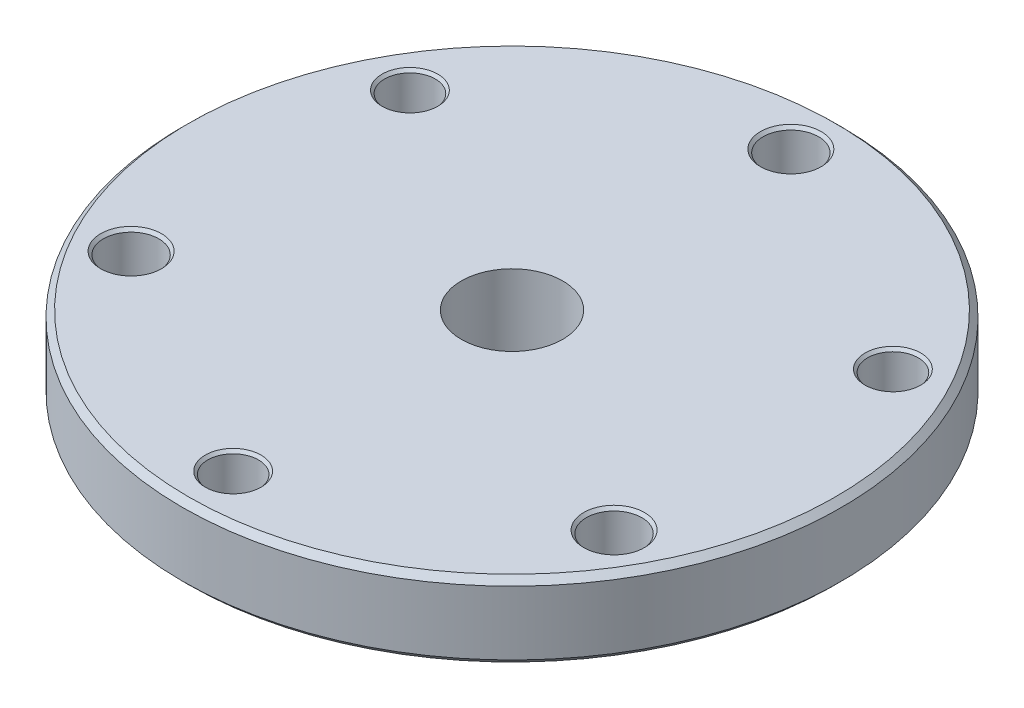
ISO-10303-21;
HEADER;
FILE_DESCRIPTION(('STEP AP214'),'2;1');
FILE_NAME('part.step','',(''),(''),'','','');
FILE_SCHEMA(('AUTOMOTIVE_DESIGN { 1 0 10303 214 1 1 1 1 }'));
ENDSEC;
DATA;
#1=APPLICATION_CONTEXT('core data for automotive mechanical design processes');
#2=APPLICATION_PROTOCOL_DEFINITION('international standard','automotive_design',2000,#1);
#3=PRODUCT_CONTEXT('',#1,'mechanical');
#4=PRODUCT('Part','Part','',(#3));
#5=PRODUCT_RELATED_PRODUCT_CATEGORY('part','',(#4));
#6=PRODUCT_DEFINITION_FORMATION('','',#4);
#7=PRODUCT_DEFINITION_CONTEXT('part definition',#1,'design');
#8=PRODUCT_DEFINITION('design','',#6,#7);
#9=PRODUCT_DEFINITION_SHAPE('','',#8);
#10=(LENGTH_UNIT() NAMED_UNIT(*) SI_UNIT(.MILLI.,.METRE.));
#11=(NAMED_UNIT(*) PLANE_ANGLE_UNIT() SI_UNIT($,.RADIAN.));
#12=(NAMED_UNIT(*) SI_UNIT($,.STERADIAN.) SOLID_ANGLE_UNIT());
#13=UNCERTAINTY_MEASURE_WITH_UNIT(LENGTH_MEASURE(1.E-05),#10,'distance_accuracy_value','');
#14=(GEOMETRIC_REPRESENTATION_CONTEXT(3) GLOBAL_UNCERTAINTY_ASSIGNED_CONTEXT((#13)) GLOBAL_UNIT_ASSIGNED_CONTEXT((#10,
#11,#12)) REPRESENTATION_CONTEXT('',''));
#15=CARTESIAN_POINT('',(0.,0.,0.));
#16=DIRECTION('',(0.,0.,1.));
#17=DIRECTION('',(1.,0.,0.));
#18=AXIS2_PLACEMENT_3D('',#15,#16,#17);
#19=CARTESIAN_POINT('',(0.,19.05,0.));
#20=DIRECTION('',(0.,-1.,0.));
#21=DIRECTION('',(0.,0.,-1.));
#22=AXIS2_PLACEMENT_3D('',#19,#20,#21);
#23=CYLINDRICAL_SURFACE('',#22,82.55);
#24=CARTESIAN_POINT('',(0.,1.52400000000011,0.));
#25=DIRECTION('',(0.,1.,0.));
#26=DIRECTION('',(0.,0.,1.));
#27=AXIS2_PLACEMENT_3D('',#24,#25,#26);
#28=CIRCLE('',#27,82.55);
#29=CARTESIAN_POINT('',(0.,1.52400000000011,82.55));
#30=VERTEX_POINT('',#29);
#31=EDGE_CURVE('E65',#30,#30,#28,.T.);
#32=ORIENTED_EDGE('',*,*,#31,.T.);
#33=EDGE_LOOP('',(#32));
#34=FACE_BOUND('',#33,.T.);
#35=CARTESIAN_POINT('',(0.,17.5260000000001,0.));
#36=DIRECTION('',(0.,1.,0.));
#37=DIRECTION('',(0.,0.,1.));
#38=AXIS2_PLACEMENT_3D('',#35,#36,#37);
#39=CIRCLE('',#38,82.55);
#40=CARTESIAN_POINT('',(0.,17.5260000000001,82.55));
#41=VERTEX_POINT('',#40);
#42=EDGE_CURVE('E69',#41,#41,#39,.F.);
#43=ORIENTED_EDGE('',*,*,#42,.T.);
#44=EDGE_LOOP('',(#43));
#45=FACE_BOUND('',#44,.T.);
#46=ADVANCED_FACE('F54',(#34,#45),#23,.T.);
#47=CARTESIAN_POINT('',(0.,19.05,0.));
#48=DIRECTION('',(0.,1.,0.));
#49=DIRECTION('',(0.,0.,1.));
#50=AXIS2_PLACEMENT_3D('',#47,#48,#49);
#51=PLANE('',#50);
#52=CARTESIAN_POINT('',(0.,19.05,0.));
#53=DIRECTION('',(0.,1.,0.));
#54=DIRECTION('',(0.,0.,1.));
#55=AXIS2_PLACEMENT_3D('',#52,#53,#54);
#56=CIRCLE('',#55,81.0260000000001);
#57=CARTESIAN_POINT('',(0.,19.05,81.0260000000001));
#58=VERTEX_POINT('',#57);
#59=EDGE_CURVE('E11',#58,#58,#56,.T.);
#60=ORIENTED_EDGE('',*,*,#59,.T.);
#61=EDGE_LOOP('',(#60));
#62=FACE_BOUND('',#61,.T.);
#63=CARTESIAN_POINT('',(0.,19.05,-69.85));
#64=DIRECTION('',(0.,1.,0.));
#65=DIRECTION('',(0.,0.,1.));
#66=AXIS2_PLACEMENT_3D('',#63,#64,#65);
#67=CIRCLE('',#66,7.62);
#68=CARTESIAN_POINT('',(0.,19.05,-62.23));
#69=VERTEX_POINT('',#68);
#70=EDGE_CURVE('E140',#69,#69,#67,.T.);
#71=ORIENTED_EDGE('',*,*,#70,.F.);
#72=EDGE_LOOP('',(#71));
#73=FACE_BOUND('',#72,.T.);
#74=CARTESIAN_POINT('',(-60.4918744543432,19.05,34.9249999999999));
#75=DIRECTION('',(0.,1.,0.));
#76=DIRECTION('',(0.,0.,1.));
#77=AXIS2_PLACEMENT_3D('',#74,#75,#76);
#78=CIRCLE('',#77,7.62);
#79=CARTESIAN_POINT('',(-60.4918744543432,19.05,42.5449999999999));
#80=VERTEX_POINT('',#79);
#81=EDGE_CURVE('E128',#80,#80,#78,.T.);
#82=ORIENTED_EDGE('',*,*,#81,.F.);
#83=EDGE_LOOP('',(#82));
#84=FACE_BOUND('',#83,.T.);
#85=CARTESIAN_POINT('',(60.4918744543432,19.05,34.9249999999999));
#86=DIRECTION('',(0.,1.,0.));
#87=DIRECTION('',(0.,0.,1.));
#88=AXIS2_PLACEMENT_3D('',#85,#86,#87);
#89=CIRCLE('',#88,7.62);
#90=CARTESIAN_POINT('',(60.4918744543432,19.05,42.5449999999999));
#91=VERTEX_POINT('',#90);
#92=EDGE_CURVE('E116',#91,#91,#89,.T.);
#93=ORIENTED_EDGE('',*,*,#92,.F.);
#94=EDGE_LOOP('',(#93));
#95=FACE_BOUND('',#94,.T.);
#96=CARTESIAN_POINT('',(0.,19.05,69.85));
#97=DIRECTION('',(0.,1.,0.));
#98=DIRECTION('',(0.,0.,1.));
#99=AXIS2_PLACEMENT_3D('',#96,#97,#98);
#100=CIRCLE('',#99,6.985);
#101=CARTESIAN_POINT('',(0.,19.05,76.835));
#102=VERTEX_POINT('',#101);
#103=EDGE_CURVE('E104',#102,#102,#100,.T.);
#104=ORIENTED_EDGE('',*,*,#103,.F.);
#105=EDGE_LOOP('',(#104));
#106=FACE_BOUND('',#105,.T.);
#107=CARTESIAN_POINT('',(-60.4918744543432,19.05,-34.9249999999999));
#108=DIRECTION('',(0.,1.,0.));
#109=DIRECTION('',(0.,0.,1.));
#110=AXIS2_PLACEMENT_3D('',#107,#108,#109);
#111=CIRCLE('',#110,6.985);
#112=CARTESIAN_POINT('',(-60.4918744543432,19.05,-27.9399999999999));
#113=VERTEX_POINT('',#112);
#114=EDGE_CURVE('E92',#113,#113,#111,.T.);
#115=ORIENTED_EDGE('',*,*,#114,.F.);
#116=EDGE_LOOP('',(#115));
#117=FACE_BOUND('',#116,.T.);
#118=CARTESIAN_POINT('',(60.4918744543432,19.05,-34.9249999999999));
#119=DIRECTION('',(0.,1.,0.));
#120=DIRECTION('',(0.,0.,1.));
#121=AXIS2_PLACEMENT_3D('',#118,#119,#120);
#122=CIRCLE('',#121,6.985);
#123=CARTESIAN_POINT('',(60.4918744543432,19.05,-27.9399999999999));
#124=VERTEX_POINT('',#123);
#125=EDGE_CURVE('E80',#124,#124,#122,.T.);
#126=ORIENTED_EDGE('',*,*,#125,.F.);
#127=EDGE_LOOP('',(#126));
#128=FACE_BOUND('',#127,.T.);
#129=CARTESIAN_POINT('',(0.,19.05,0.));
#130=DIRECTION('',(0.,1.,0.));
#131=DIRECTION('',(0.,0.,1.));
#132=AXIS2_PLACEMENT_3D('',#129,#130,#131);
#133=CIRCLE('',#132,12.7);
#134=CARTESIAN_POINT('',(0.,19.05,12.7));
#135=VERTEX_POINT('',#134);
#136=EDGE_CURVE('E77',#135,#135,#133,.T.);
#137=ORIENTED_EDGE('',*,*,#136,.F.);
#138=EDGE_LOOP('',(#137));
#139=FACE_BOUND('',#138,.T.);
#140=ADVANCED_FACE('F176',(#62,#73,#84,#95,#106,#117,#128,#139),#51,.T.);
#141=CARTESIAN_POINT('',(0.,0.,0.));
#142=DIRECTION('',(0.,1.,0.));
#143=DIRECTION('',(0.,0.,1.));
#144=AXIS2_PLACEMENT_3D('',#141,#142,#143);
#145=PLANE('',#144);
#146=CARTESIAN_POINT('',(0.,0.,0.));
#147=DIRECTION('',(0.,1.,0.));
#148=DIRECTION('',(0.,0.,1.));
#149=AXIS2_PLACEMENT_3D('',#146,#147,#148);
#150=CIRCLE('',#149,81.0259999999999);
#151=CARTESIAN_POINT('',(0.,0.,81.0259999999999));
#152=VERTEX_POINT('',#151);
#153=EDGE_CURVE('E61',#152,#152,#150,.F.);
#154=ORIENTED_EDGE('',*,*,#153,.T.);
#155=EDGE_LOOP('',(#154));
#156=FACE_BOUND('',#155,.T.);
#157=CARTESIAN_POINT('',(0.,0.,-69.85));
#158=DIRECTION('',(0.,1.,0.));
#159=DIRECTION('',(0.,0.,1.));
#160=AXIS2_PLACEMENT_3D('',#157,#158,#159);
#161=CIRCLE('',#160,7.61999999999999);
#162=CARTESIAN_POINT('',(0.,0.,-62.23));
#163=VERTEX_POINT('',#162);
#164=EDGE_CURVE('E149',#163,#163,#161,.T.);
#165=ORIENTED_EDGE('',*,*,#164,.T.);
#166=EDGE_LOOP('',(#165));
#167=FACE_BOUND('',#166,.T.);
#168=CARTESIAN_POINT('',(-60.4918744543432,0.,34.9249999999999));
#169=DIRECTION('',(0.,1.,0.));
#170=DIRECTION('',(0.,0.,1.));
#171=AXIS2_PLACEMENT_3D('',#168,#169,#170);
#172=CIRCLE('',#171,7.61999999999999);
#173=CARTESIAN_POINT('',(-60.4918744543432,0.,42.5449999999999));
#174=VERTEX_POINT('',#173);
#175=EDGE_CURVE('E137',#174,#174,#172,.T.);
#176=ORIENTED_EDGE('',*,*,#175,.T.);
#177=EDGE_LOOP('',(#176));
#178=FACE_BOUND('',#177,.T.);
#179=CARTESIAN_POINT('',(60.4918744543432,0.,34.9249999999999));
#180=DIRECTION('',(0.,1.,0.));
#181=DIRECTION('',(0.,0.,1.));
#182=AXIS2_PLACEMENT_3D('',#179,#180,#181);
#183=CIRCLE('',#182,7.62);
#184=CARTESIAN_POINT('',(60.4918744543432,0.,42.5449999999999));
#185=VERTEX_POINT('',#184);
#186=EDGE_CURVE('E125',#185,#185,#183,.T.);
#187=ORIENTED_EDGE('',*,*,#186,.T.);
#188=EDGE_LOOP('',(#187));
#189=FACE_BOUND('',#188,.T.);
#190=CARTESIAN_POINT('',(0.,0.,69.85));
#191=DIRECTION('',(0.,1.,0.));
#192=DIRECTION('',(0.,0.,1.));
#193=AXIS2_PLACEMENT_3D('',#190,#191,#192);
#194=CIRCLE('',#193,6.98499999999999);
#195=CARTESIAN_POINT('',(0.,0.,76.835));
#196=VERTEX_POINT('',#195);
#197=EDGE_CURVE('E113',#196,#196,#194,.T.);
#198=ORIENTED_EDGE('',*,*,#197,.T.);
#199=EDGE_LOOP('',(#198));
#200=FACE_BOUND('',#199,.T.);
#201=CARTESIAN_POINT('',(-60.4918744543432,0.,-34.9249999999999));
#202=DIRECTION('',(0.,1.,0.));
#203=DIRECTION('',(0.,0.,1.));
#204=AXIS2_PLACEMENT_3D('',#201,#202,#203);
#205=CIRCLE('',#204,6.985);
#206=CARTESIAN_POINT('',(-60.4918744543432,0.,-27.9399999999999));
#207=VERTEX_POINT('',#206);
#208=EDGE_CURVE('E101',#207,#207,#205,.T.);
#209=ORIENTED_EDGE('',*,*,#208,.T.);
#210=EDGE_LOOP('',(#209));
#211=FACE_BOUND('',#210,.T.);
#212=CARTESIAN_POINT('',(60.4918744543432,0.,-34.9249999999999));
#213=DIRECTION('',(0.,1.,0.));
#214=DIRECTION('',(0.,0.,1.));
#215=AXIS2_PLACEMENT_3D('',#212,#213,#214);
#216=CIRCLE('',#215,6.985);
#217=CARTESIAN_POINT('',(60.4918744543432,0.,-27.9399999999999));
#218=VERTEX_POINT('',#217);
#219=EDGE_CURVE('E89',#218,#218,#216,.T.);
#220=ORIENTED_EDGE('',*,*,#219,.T.);
#221=EDGE_LOOP('',(#220));
#222=FACE_BOUND('',#221,.T.);
#223=CARTESIAN_POINT('',(0.,0.,0.));
#224=DIRECTION('',(0.,1.,0.));
#225=DIRECTION('',(0.,0.,1.));
#226=AXIS2_PLACEMENT_3D('',#223,#224,#225);
#227=CIRCLE('',#226,12.7);
#228=CARTESIAN_POINT('',(0.,0.,12.7));
#229=VERTEX_POINT('',#228);
#230=EDGE_CURVE('E74',#229,#229,#227,.T.);
#231=ORIENTED_EDGE('',*,*,#230,.T.);
#232=EDGE_LOOP('',(#231));
#233=FACE_BOUND('',#232,.T.);
#234=ADVANCED_FACE('F153',(#156,#167,#178,#189,#200,#211,#222,#233),#145,.F.);
#235=CARTESIAN_POINT('',(0.,19.05,0.));
#236=DIRECTION('',(0.,1.,0.));
#237=DIRECTION('',(0.,0.,1.));
#238=AXIS2_PLACEMENT_3D('',#235,#236,#237);
#239=CYLINDRICAL_SURFACE('',#238,12.7);
#240=ORIENTED_EDGE('',*,*,#230,.F.);
#241=EDGE_LOOP('',(#240));
#242=FACE_BOUND('',#241,.T.);
#243=ORIENTED_EDGE('',*,*,#136,.T.);
#244=EDGE_LOOP('',(#243));
#245=FACE_BOUND('',#244,.T.);
#246=ADVANCED_FACE('F192',(#242,#245),#239,.F.);
#247=CARTESIAN_POINT('',(60.4918744543432,19.05,-34.9249999999999));
#248=DIRECTION('',(0.,1.,0.));
#249=DIRECTION('',(0.,0.,1.));
#250=AXIS2_PLACEMENT_3D('',#247,#248,#249);
#251=CONICAL_SURFACE('',#250,6.985,0.715584993317672);
#252=CARTESIAN_POINT('',(60.4918744543432,18.3195160614147,-34.9249999999999));
#253=DIRECTION('',(0.,1.,0.));
#254=DIRECTION('',(0.,0.,1.));
#255=AXIS2_PLACEMENT_3D('',#252,#253,#254);
#256=CIRCLE('',#255,6.35);
#257=CARTESIAN_POINT('',(60.4918744543432,18.3195160614147,-28.5749999999999));
#258=VERTEX_POINT('',#257);
#259=EDGE_CURVE('E83',#258,#258,#256,.T.);
#260=ORIENTED_EDGE('',*,*,#259,.F.);
#261=EDGE_LOOP('',(#260));
#262=FACE_BOUND('',#261,.T.);
#263=ORIENTED_EDGE('',*,*,#125,.T.);
#264=EDGE_LOOP('',(#263));
#265=FACE_BOUND('',#264,.T.);
#266=ADVANCED_FACE('F194',(#262,#265),#251,.F.);
#267=CARTESIAN_POINT('',(60.4918744543432,19.05,-34.9249999999999));
#268=DIRECTION('',(0.,1.,0.));
#269=DIRECTION('',(0.,0.,1.));
#270=AXIS2_PLACEMENT_3D('',#267,#268,#269);
#271=CYLINDRICAL_SURFACE('',#270,6.35);
#272=CARTESIAN_POINT('',(60.4918744543432,0.730483938585342,-34.9249999999999));
#273=DIRECTION('',(0.,1.,0.));
#274=DIRECTION('',(0.,0.,1.));
#275=AXIS2_PLACEMENT_3D('',#272,#273,#274);
#276=CIRCLE('',#275,6.35);
#277=CARTESIAN_POINT('',(60.4918744543432,0.730483938585342,-28.5749999999999));
#278=VERTEX_POINT('',#277);
#279=EDGE_CURVE('E86',#278,#278,#276,.T.);
#280=ORIENTED_EDGE('',*,*,#279,.F.);
#281=EDGE_LOOP('',(#280));
#282=FACE_BOUND('',#281,.T.);
#283=ORIENTED_EDGE('',*,*,#259,.T.);
#284=EDGE_LOOP('',(#283));
#285=FACE_BOUND('',#284,.T.);
#286=ADVANCED_FACE('F201',(#282,#285),#271,.F.);
#287=CARTESIAN_POINT('',(60.4918744543432,0.730483938585342,-34.9249999999999));
#288=DIRECTION('',(0.,-1.,0.));
#289=DIRECTION('',(0.,0.,-1.));
#290=AXIS2_PLACEMENT_3D('',#287,#288,#289);
#291=CONICAL_SURFACE('',#290,6.35,0.715584993317674);
#292=ORIENTED_EDGE('',*,*,#219,.F.);
#293=EDGE_LOOP('',(#292));
#294=FACE_BOUND('',#293,.T.);
#295=ORIENTED_EDGE('',*,*,#279,.T.);
#296=EDGE_LOOP('',(#295));
#297=FACE_BOUND('',#296,.T.);
#298=ADVANCED_FACE('F366',(#294,#297),#291,.F.);
#299=CARTESIAN_POINT('',(-60.4918744543432,19.05,-34.9249999999999));
#300=DIRECTION('',(0.,1.,0.));
#301=DIRECTION('',(0.,0.,1.));
#302=AXIS2_PLACEMENT_3D('',#299,#300,#301);
#303=CONICAL_SURFACE('',#302,6.985,0.715584993317672);
#304=CARTESIAN_POINT('',(-60.4918744543432,18.3195160614147,-34.9249999999999));
#305=DIRECTION('',(0.,1.,0.));
#306=DIRECTION('',(0.,0.,1.));
#307=AXIS2_PLACEMENT_3D('',#304,#305,#306);
#308=CIRCLE('',#307,6.35);
#309=CARTESIAN_POINT('',(-60.4918744543432,18.3195160614147,-28.5749999999999));
#310=VERTEX_POINT('',#309);
#311=EDGE_CURVE('E95',#310,#310,#308,.T.);
#312=ORIENTED_EDGE('',*,*,#311,.F.);
#313=EDGE_LOOP('',(#312));
#314=FACE_BOUND('',#313,.T.);
#315=ORIENTED_EDGE('',*,*,#114,.T.);
#316=EDGE_LOOP('',(#315));
#317=FACE_BOUND('',#316,.T.);
#318=ADVANCED_FACE('F356',(#314,#317),#303,.F.);
#319=CARTESIAN_POINT('',(-60.4918744543432,19.05,-34.9249999999999));
#320=DIRECTION('',(0.,1.,0.));
#321=DIRECTION('',(0.,0.,1.));
#322=AXIS2_PLACEMENT_3D('',#319,#320,#321);
#323=CYLINDRICAL_SURFACE('',#322,6.35);
#324=CARTESIAN_POINT('',(-60.4918744543432,0.730483938585342,-34.9249999999999));
#325=DIRECTION('',(0.,1.,0.));
#326=DIRECTION('',(0.,0.,1.));
#327=AXIS2_PLACEMENT_3D('',#324,#325,#326);
#328=CIRCLE('',#327,6.34999999999999);
#329=CARTESIAN_POINT('',(-60.4918744543432,0.730483938585342,-28.5749999999999));
#330=VERTEX_POINT('',#329);
#331=EDGE_CURVE('E98',#330,#330,#328,.T.);
#332=ORIENTED_EDGE('',*,*,#331,.F.);
#333=EDGE_LOOP('',(#332));
#334=FACE_BOUND('',#333,.T.);
#335=ORIENTED_EDGE('',*,*,#311,.T.);
#336=EDGE_LOOP('',(#335));
#337=FACE_BOUND('',#336,.T.);
#338=ADVANCED_FACE('F346',(#334,#337),#323,.F.);
#339=CARTESIAN_POINT('',(-60.4918744543432,0.730483938585342,-34.9249999999999));
#340=DIRECTION('',(0.,-1.,0.));
#341=DIRECTION('',(0.,0.,-1.));
#342=AXIS2_PLACEMENT_3D('',#339,#340,#341);
#343=CONICAL_SURFACE('',#342,6.34999999999999,0.71558499331768);
#344=ORIENTED_EDGE('',*,*,#208,.F.);
#345=EDGE_LOOP('',(#344));
#346=FACE_BOUND('',#345,.T.);
#347=ORIENTED_EDGE('',*,*,#331,.T.);
#348=EDGE_LOOP('',(#347));
#349=FACE_BOUND('',#348,.T.);
#350=ADVANCED_FACE('F336',(#346,#349),#343,.F.);
#351=CARTESIAN_POINT('',(0.,19.05,69.85));
#352=DIRECTION('',(0.,1.,0.));
#353=DIRECTION('',(0.,0.,1.));
#354=AXIS2_PLACEMENT_3D('',#351,#352,#353);
#355=CONICAL_SURFACE('',#354,6.985,0.715584993317676);
#356=CARTESIAN_POINT('',(0.,18.3195160614147,69.85));
#357=DIRECTION('',(0.,1.,0.));
#358=DIRECTION('',(0.,0.,1.));
#359=AXIS2_PLACEMENT_3D('',#356,#357,#358);
#360=CIRCLE('',#359,6.35);
#361=CARTESIAN_POINT('',(0.,18.3195160614147,76.2));
#362=VERTEX_POINT('',#361);
#363=EDGE_CURVE('E107',#362,#362,#360,.T.);
#364=ORIENTED_EDGE('',*,*,#363,.F.);
#365=EDGE_LOOP('',(#364));
#366=FACE_BOUND('',#365,.T.);
#367=ORIENTED_EDGE('',*,*,#103,.T.);
#368=EDGE_LOOP('',(#367));
#369=FACE_BOUND('',#368,.T.);
#370=ADVANCED_FACE('F326',(#366,#369),#355,.F.);
#371=CARTESIAN_POINT('',(0.,19.05,69.85));
#372=DIRECTION('',(0.,1.,0.));
#373=DIRECTION('',(0.,0.,1.));
#374=AXIS2_PLACEMENT_3D('',#371,#372,#373);
#375=CYLINDRICAL_SURFACE('',#374,6.35);
#376=CARTESIAN_POINT('',(0.,0.730483938585342,69.85));
#377=DIRECTION('',(0.,1.,0.));
#378=DIRECTION('',(0.,0.,1.));
#379=AXIS2_PLACEMENT_3D('',#376,#377,#378);
#380=CIRCLE('',#379,6.35);
#381=CARTESIAN_POINT('',(0.,0.730483938585342,76.2));
#382=VERTEX_POINT('',#381);
#383=EDGE_CURVE('E110',#382,#382,#380,.T.);
#384=ORIENTED_EDGE('',*,*,#383,.F.);
#385=EDGE_LOOP('',(#384));
#386=FACE_BOUND('',#385,.T.);
#387=ORIENTED_EDGE('',*,*,#363,.T.);
#388=EDGE_LOOP('',(#387));
#389=FACE_BOUND('',#388,.T.);
#390=ADVANCED_FACE('F315',(#386,#389),#375,.F.);
#391=CARTESIAN_POINT('',(0.,0.730483938585342,69.85));
#392=DIRECTION('',(0.,-1.,0.));
#393=DIRECTION('',(0.,0.,-1.));
#394=AXIS2_PLACEMENT_3D('',#391,#392,#393);
#395=CONICAL_SURFACE('',#394,6.35,0.715584993317676);
#396=ORIENTED_EDGE('',*,*,#197,.F.);
#397=EDGE_LOOP('',(#396));
#398=FACE_BOUND('',#397,.T.);
#399=ORIENTED_EDGE('',*,*,#383,.T.);
#400=EDGE_LOOP('',(#399));
#401=FACE_BOUND('',#400,.T.);
#402=ADVANCED_FACE('F305',(#398,#401),#395,.F.);
#403=CARTESIAN_POINT('',(60.4918744543432,19.05,34.9249999999999));
#404=DIRECTION('',(0.,1.,0.));
#405=DIRECTION('',(0.,0.,1.));
#406=AXIS2_PLACEMENT_3D('',#403,#404,#405);
#407=CONICAL_SURFACE('',#406,7.62,0.715584993317679);
#408=CARTESIAN_POINT('',(60.4918744543432,18.2742260572224,34.9249999999999));
#409=DIRECTION('',(0.,1.,0.));
#410=DIRECTION('',(0.,0.,1.));
#411=AXIS2_PLACEMENT_3D('',#408,#409,#410);
#412=CIRCLE('',#411,6.94562999999999);
#413=CARTESIAN_POINT('',(60.4918744543432,18.2742260572224,41.8706299999999));
#414=VERTEX_POINT('',#413);
#415=EDGE_CURVE('E119',#414,#414,#412,.T.);
#416=ORIENTED_EDGE('',*,*,#415,.F.);
#417=EDGE_LOOP('',(#416));
#418=FACE_BOUND('',#417,.T.);
#419=ORIENTED_EDGE('',*,*,#92,.T.);
#420=EDGE_LOOP('',(#419));
#421=FACE_BOUND('',#420,.T.);
#422=ADVANCED_FACE('F295',(#418,#421),#407,.F.);
#423=CARTESIAN_POINT('',(60.4918744543432,19.05,34.9249999999999));
#424=DIRECTION('',(0.,1.,0.));
#425=DIRECTION('',(0.,0.,1.));
#426=AXIS2_PLACEMENT_3D('',#423,#424,#425);
#427=CYLINDRICAL_SURFACE('',#426,6.94562999999999);
#428=CARTESIAN_POINT('',(60.4918744543432,0.775773942777631,34.9249999999999));
#429=DIRECTION('',(0.,1.,0.));
#430=DIRECTION('',(0.,0.,1.));
#431=AXIS2_PLACEMENT_3D('',#428,#429,#430);
#432=CIRCLE('',#431,6.94562999999999);
#433=CARTESIAN_POINT('',(60.4918744543432,0.775773942777631,41.8706299999999));
#434=VERTEX_POINT('',#433);
#435=EDGE_CURVE('E122',#434,#434,#432,.T.);
#436=ORIENTED_EDGE('',*,*,#435,.F.);
#437=EDGE_LOOP('',(#436));
#438=FACE_BOUND('',#437,.T.);
#439=ORIENTED_EDGE('',*,*,#415,.T.);
#440=EDGE_LOOP('',(#439));
#441=FACE_BOUND('',#440,.T.);
#442=ADVANCED_FACE('F285',(#438,#441),#427,.F.);
#443=CARTESIAN_POINT('',(60.4918744543432,0.775773942777631,34.9249999999999));
#444=DIRECTION('',(0.,-1.,0.));
#445=DIRECTION('',(0.,0.,-1.));
#446=AXIS2_PLACEMENT_3D('',#443,#444,#445);
#447=CONICAL_SURFACE('',#446,6.94562999999999,0.715584993317684);
#448=ORIENTED_EDGE('',*,*,#186,.F.);
#449=EDGE_LOOP('',(#448));
#450=FACE_BOUND('',#449,.T.);
#451=ORIENTED_EDGE('',*,*,#435,.T.);
#452=EDGE_LOOP('',(#451));
#453=FACE_BOUND('',#452,.T.);
#454=ADVANCED_FACE('F275',(#450,#453),#447,.F.);
#455=CARTESIAN_POINT('',(-60.4918744543432,19.05,34.9249999999999));
#456=DIRECTION('',(0.,1.,0.));
#457=DIRECTION('',(0.,0.,1.));
#458=AXIS2_PLACEMENT_3D('',#455,#456,#457);
#459=CONICAL_SURFACE('',#458,7.62,0.715584993317674);
#460=CARTESIAN_POINT('',(-60.4918744543432,18.2742260572224,34.9249999999999));
#461=DIRECTION('',(0.,1.,0.));
#462=DIRECTION('',(0.,0.,1.));
#463=AXIS2_PLACEMENT_3D('',#460,#461,#462);
#464=CIRCLE('',#463,6.94563);
#465=CARTESIAN_POINT('',(-60.4918744543432,18.2742260572224,41.8706299999999));
#466=VERTEX_POINT('',#465);
#467=EDGE_CURVE('E131',#466,#466,#464,.T.);
#468=ORIENTED_EDGE('',*,*,#467,.F.);
#469=EDGE_LOOP('',(#468));
#470=FACE_BOUND('',#469,.T.);
#471=ORIENTED_EDGE('',*,*,#81,.T.);
#472=EDGE_LOOP('',(#471));
#473=FACE_BOUND('',#472,.T.);
#474=ADVANCED_FACE('F265',(#470,#473),#459,.F.);
#475=CARTESIAN_POINT('',(-60.4918744543432,19.05,34.9249999999999));
#476=DIRECTION('',(0.,1.,0.));
#477=DIRECTION('',(0.,0.,1.));
#478=AXIS2_PLACEMENT_3D('',#475,#476,#477);
#479=CYLINDRICAL_SURFACE('',#478,6.94563);
#480=CARTESIAN_POINT('',(-60.4918744543432,0.775773942777631,34.9249999999999));
#481=DIRECTION('',(0.,1.,0.));
#482=DIRECTION('',(0.,0.,1.));
#483=AXIS2_PLACEMENT_3D('',#480,#481,#482);
#484=CIRCLE('',#483,6.94562999999999);
#485=CARTESIAN_POINT('',(-60.4918744543432,0.775773942777631,41.8706299999999));
#486=VERTEX_POINT('',#485);
#487=EDGE_CURVE('E134',#486,#486,#484,.T.);
#488=ORIENTED_EDGE('',*,*,#487,.F.);
#489=EDGE_LOOP('',(#488));
#490=FACE_BOUND('',#489,.T.);
#491=ORIENTED_EDGE('',*,*,#467,.T.);
#492=EDGE_LOOP('',(#491));
#493=FACE_BOUND('',#492,.T.);
#494=ADVANCED_FACE('F255',(#490,#493),#479,.F.);
#495=CARTESIAN_POINT('',(-60.4918744543432,0.775773942777631,34.9249999999999));
#496=DIRECTION('',(0.,-1.,0.));
#497=DIRECTION('',(0.,0.,-1.));
#498=AXIS2_PLACEMENT_3D('',#495,#496,#497);
#499=CONICAL_SURFACE('',#498,6.94562999999999,0.715584993317679);
#500=ORIENTED_EDGE('',*,*,#175,.F.);
#501=EDGE_LOOP('',(#500));
#502=FACE_BOUND('',#501,.T.);
#503=ORIENTED_EDGE('',*,*,#487,.T.);
#504=EDGE_LOOP('',(#503));
#505=FACE_BOUND('',#504,.T.);
#506=ADVANCED_FACE('F172',(#502,#505),#499,.F.);
#507=CARTESIAN_POINT('',(0.,19.05,-69.85));
#508=DIRECTION('',(0.,1.,0.));
#509=DIRECTION('',(0.,0.,1.));
#510=AXIS2_PLACEMENT_3D('',#507,#508,#509);
#511=CONICAL_SURFACE('',#510,7.62,0.715584993317674);
#512=CARTESIAN_POINT('',(0.,18.2742260572224,-69.85));
#513=DIRECTION('',(0.,1.,0.));
#514=DIRECTION('',(0.,0.,1.));
#515=AXIS2_PLACEMENT_3D('',#512,#513,#514);
#516=CIRCLE('',#515,6.94563);
#517=CARTESIAN_POINT('',(0.,18.2742260572224,-62.90437));
#518=VERTEX_POINT('',#517);
#519=EDGE_CURVE('E143',#518,#518,#516,.T.);
#520=ORIENTED_EDGE('',*,*,#519,.F.);
#521=EDGE_LOOP('',(#520));
#522=FACE_BOUND('',#521,.T.);
#523=ORIENTED_EDGE('',*,*,#70,.T.);
#524=EDGE_LOOP('',(#523));
#525=FACE_BOUND('',#524,.T.);
#526=ADVANCED_FACE('F166',(#522,#525),#511,.F.);
#527=CARTESIAN_POINT('',(0.,19.05,-69.85));
#528=DIRECTION('',(0.,1.,0.));
#529=DIRECTION('',(0.,0.,1.));
#530=AXIS2_PLACEMENT_3D('',#527,#528,#529);
#531=CYLINDRICAL_SURFACE('',#530,6.94563);
#532=CARTESIAN_POINT('',(0.,0.775773942777631,-69.85));
#533=DIRECTION('',(0.,1.,0.));
#534=DIRECTION('',(0.,0.,1.));
#535=AXIS2_PLACEMENT_3D('',#532,#533,#534);
#536=CIRCLE('',#535,6.94563);
#537=CARTESIAN_POINT('',(0.,0.775773942777631,-62.90437));
#538=VERTEX_POINT('',#537);
#539=EDGE_CURVE('E146',#538,#538,#536,.T.);
#540=ORIENTED_EDGE('',*,*,#539,.F.);
#541=EDGE_LOOP('',(#540));
#542=FACE_BOUND('',#541,.T.);
#543=ORIENTED_EDGE('',*,*,#519,.T.);
#544=EDGE_LOOP('',(#543));
#545=FACE_BOUND('',#544,.T.);
#546=ADVANCED_FACE('F160',(#542,#545),#531,.F.);
#547=CARTESIAN_POINT('',(0.,0.775773942777631,-69.85));
#548=DIRECTION('',(0.,-1.,0.));
#549=DIRECTION('',(0.,0.,-1.));
#550=AXIS2_PLACEMENT_3D('',#547,#548,#549);
#551=CONICAL_SURFACE('',#550,6.94563,0.715584993317677);
#552=ORIENTED_EDGE('',*,*,#164,.F.);
#553=EDGE_LOOP('',(#552));
#554=FACE_BOUND('',#553,.T.);
#555=ORIENTED_EDGE('',*,*,#539,.T.);
#556=EDGE_LOOP('',(#555));
#557=FACE_BOUND('',#556,.T.);
#558=ADVANCED_FACE('F156',(#554,#557),#551,.F.);
#559=CARTESIAN_POINT('',(0.,1.52400000000011,0.));
#560=DIRECTION('',(0.,1.,0.));
#561=DIRECTION('',(0.,0.,1.));
#562=AXIS2_PLACEMENT_3D('',#559,#560,#561);
#563=CONICAL_SURFACE('',#562,82.55,0.785398163397448);
#564=ORIENTED_EDGE('',*,*,#153,.F.);
#565=EDGE_LOOP('',(#564));
#566=FACE_BOUND('',#565,.T.);
#567=ORIENTED_EDGE('',*,*,#31,.F.);
#568=EDGE_LOOP('',(#567));
#569=FACE_BOUND('',#568,.T.);
#570=ADVANCED_FACE('F159',(#566,#569),#563,.T.);
#571=CARTESIAN_POINT('',(0.,19.05,0.));
#572=DIRECTION('',(0.,-1.,0.));
#573=DIRECTION('',(0.,0.,-1.));
#574=AXIS2_PLACEMENT_3D('',#571,#572,#573);
#575=CONICAL_SURFACE('',#574,81.0260000000001,0.785398163397453);
#576=ORIENTED_EDGE('',*,*,#42,.F.);
#577=EDGE_LOOP('',(#576));
#578=FACE_BOUND('',#577,.T.);
#579=ORIENTED_EDGE('',*,*,#59,.F.);
#580=EDGE_LOOP('',(#579));
#581=FACE_BOUND('',#580,.T.);
#582=ADVANCED_FACE('F56',(#578,#581),#575,.T.);
#583=CLOSED_SHELL('',(#46,#140,#234,#246,#266,#286,#298,#318,#338,#350,#370,#390,#402,#422,#442,
#454,#474,#494,#506,#526,#546,#558,#570,#582));
#584=MANIFOLD_SOLID_BREP('B2',#583);
#585=ADVANCED_BREP_SHAPE_REPRESENTATION('',(#18,#584),#14);
#586=SHAPE_DEFINITION_REPRESENTATION(#9,#585);
ENDSEC;
END-ISO-10303-21;
